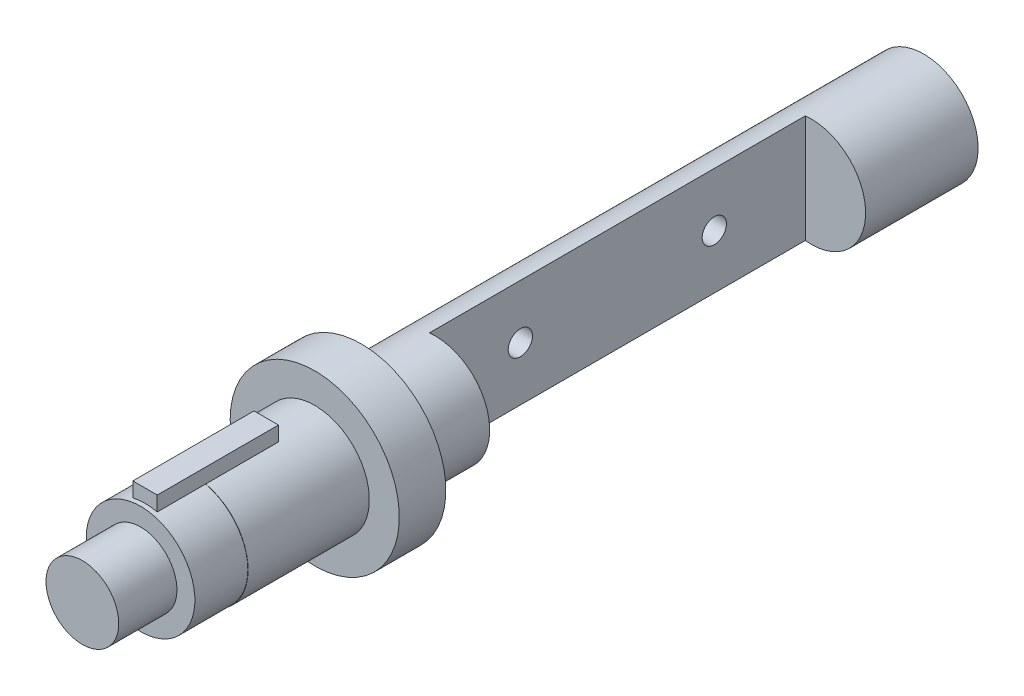
ISO-10303-21;
HEADER;
FILE_DESCRIPTION(('STEP AP214'),'2;1');
FILE_NAME('part.step','',(''),(''),'','','');
FILE_SCHEMA(('AUTOMOTIVE_DESIGN { 1 0 10303 214 1 1 1 1 }'));
ENDSEC;
DATA;
#1=APPLICATION_CONTEXT('core data for automotive mechanical design processes');
#2=APPLICATION_PROTOCOL_DEFINITION('international standard','automotive_design',2000,#1);
#3=PRODUCT_CONTEXT('',#1,'mechanical');
#4=PRODUCT('Part','Part','',(#3));
#5=PRODUCT_RELATED_PRODUCT_CATEGORY('part','',(#4));
#6=PRODUCT_DEFINITION_FORMATION('','',#4);
#7=PRODUCT_DEFINITION_CONTEXT('part definition',#1,'design');
#8=PRODUCT_DEFINITION('design','',#6,#7);
#9=PRODUCT_DEFINITION_SHAPE('','',#8);
#10=(LENGTH_UNIT() NAMED_UNIT(*) SI_UNIT(.MILLI.,.METRE.));
#11=(NAMED_UNIT(*) PLANE_ANGLE_UNIT() SI_UNIT($,.RADIAN.));
#12=(NAMED_UNIT(*) SI_UNIT($,.STERADIAN.) SOLID_ANGLE_UNIT());
#13=UNCERTAINTY_MEASURE_WITH_UNIT(LENGTH_MEASURE(1.E-05),#10,'distance_accuracy_value','');
#14=(GEOMETRIC_REPRESENTATION_CONTEXT(3) GLOBAL_UNCERTAINTY_ASSIGNED_CONTEXT((#13)) GLOBAL_UNIT_ASSIGNED_CONTEXT((#10,
#11,#12)) REPRESENTATION_CONTEXT('',''));
#15=CARTESIAN_POINT('',(0.,0.,0.));
#16=DIRECTION('',(0.,0.,1.));
#17=DIRECTION('',(1.,0.,0.));
#18=AXIS2_PLACEMENT_3D('',#15,#16,#17);
#19=CARTESIAN_POINT('',(0.,0.,376.5));
#20=DIRECTION('',(0.,0.,-1.));
#21=DIRECTION('',(-1.,0.,0.));
#22=AXIS2_PLACEMENT_3D('',#19,#20,#21);
#23=CYLINDRICAL_SURFACE('',#22,28.15);
#24=CARTESIAN_POINT('',(0.,0.,314.));
#25=DIRECTION('',(0.,0.,-1.));
#26=DIRECTION('',(-1.,0.,0.));
#27=AXIS2_PLACEMENT_3D('',#24,#25,#26);
#28=CIRCLE('',#27,28.15);
#29=CARTESIAN_POINT('',(-28.15,0.,314.));
#30=VERTEX_POINT('',#29);
#31=EDGE_CURVE('E113',#30,#30,#28,.F.);
#32=ORIENTED_EDGE('',*,*,#31,.T.);
#33=EDGE_LOOP('',(#32));
#34=FACE_BOUND('',#33,.T.);
#35=DIRECTION('',(0.,0.,-1.));
#36=VECTOR('',#35,1.);
#37=CARTESIAN_POINT('',(-6.3,27.435970914112,376.5));
#38=LINE('',#37,#36);
#39=CARTESIAN_POINT('',(-6.3,27.435970914112,339.));
#40=VERTEX_POINT('',#39);
#41=CARTESIAN_POINT('',(-6.3,27.435970914112,376.5));
#42=VERTEX_POINT('',#41);
#43=EDGE_CURVE('E95',#40,#42,#38,.F.);
#44=ORIENTED_EDGE('',*,*,#43,.F.);
#45=CARTESIAN_POINT('',(0.,0.,339.));
#46=DIRECTION('',(0.,0.,-1.));
#47=DIRECTION('',(1.,0.,0.));
#48=AXIS2_PLACEMENT_3D('',#45,#46,#47);
#49=CIRCLE('',#48,28.15);
#50=CARTESIAN_POINT('',(6.3,27.435970914112,339.));
#51=VERTEX_POINT('',#50);
#52=EDGE_CURVE('E55',#40,#51,#49,.T.);
#53=ORIENTED_EDGE('',*,*,#52,.T.);
#54=DIRECTION('',(0.,0.,-1.));
#55=VECTOR('',#54,1.);
#56=CARTESIAN_POINT('',(6.3,27.435970914112,376.5));
#57=LINE('',#56,#55);
#58=CARTESIAN_POINT('',(6.3,27.435970914112,376.5));
#59=VERTEX_POINT('',#58);
#60=EDGE_CURVE('E111',#59,#51,#57,.T.);
#61=ORIENTED_EDGE('',*,*,#60,.F.);
#62=CARTESIAN_POINT('',(0.,0.,376.5));
#63=DIRECTION('',(0.,0.,1.));
#64=DIRECTION('',(1.,0.,0.));
#65=AXIS2_PLACEMENT_3D('',#62,#63,#64);
#66=CIRCLE('',#65,28.15);
#67=EDGE_CURVE('E143',#42,#59,#66,.T.);
#68=ORIENTED_EDGE('',*,*,#67,.F.);
#69=EDGE_LOOP('',(#44,#53,#61,#68));
#70=FACE_BOUND('',#69,.T.);
#71=ADVANCED_FACE('F33',(#34,#70),#23,.T.);
#72=CARTESIAN_POINT('',(43.6,0.,314.));
#73=DIRECTION('',(0.,0.,-1.));
#74=DIRECTION('',(-1.,0.,0.));
#75=AXIS2_PLACEMENT_3D('',#72,#73,#74);
#76=PLANE('',#75);
#77=CARTESIAN_POINT('',(0.,0.,314.));
#78=DIRECTION('',(0.,0.,-1.));
#79=DIRECTION('',(-1.,0.,0.));
#80=AXIS2_PLACEMENT_3D('',#77,#78,#79);
#81=CIRCLE('',#80,43.6);
#82=CARTESIAN_POINT('',(-43.6,0.,314.));
#83=VERTEX_POINT('',#82);
#84=EDGE_CURVE('E130',#83,#83,#81,.T.);
#85=ORIENTED_EDGE('',*,*,#84,.F.);
#86=EDGE_LOOP('',(#85));
#87=FACE_BOUND('',#86,.T.);
#88=ORIENTED_EDGE('',*,*,#31,.F.);
#89=EDGE_LOOP('',(#88));
#90=FACE_BOUND('',#89,.T.);
#91=ADVANCED_FACE('F233',(#87,#90),#76,.F.);
#92=CARTESIAN_POINT('',(0.,0.,0.));
#93=DIRECTION('',(0.,0.,1.));
#94=DIRECTION('',(1.,0.,0.));
#95=AXIS2_PLACEMENT_3D('',#92,#93,#94);
#96=PLANE('',#95);
#97=CARTESIAN_POINT('',(0.,0.,0.));
#98=DIRECTION('',(0.,0.,-1.));
#99=DIRECTION('',(-1.,0.,0.));
#100=AXIS2_PLACEMENT_3D('',#97,#98,#99);
#101=CIRCLE('',#100,28.);
#102=CARTESIAN_POINT('',(-28.,0.,0.));
#103=VERTEX_POINT('',#102);
#104=EDGE_CURVE('E116',#103,#103,#101,.T.);
#105=ORIENTED_EDGE('',*,*,#104,.T.);
#106=EDGE_LOOP('',(#105));
#107=FACE_BOUND('',#106,.T.);
#108=ADVANCED_FACE('F35',(#107),#96,.F.);
#109=CARTESIAN_POINT('',(0.,0.,0.));
#110=DIRECTION('',(0.,0.,-1.));
#111=DIRECTION('',(-1.,0.,0.));
#112=AXIS2_PLACEMENT_3D('',#109,#110,#111);
#113=CYLINDRICAL_SURFACE('',#112,28.);
#114=CARTESIAN_POINT('',(-28.,0.,111.15));
#115=CARTESIAN_POINT('',(-28.0000023074908,-0.173287733266384,111.150004157336));
#116=CARTESIAN_POINT('',(-27.9983887060988,-0.346526436476237,111.142791597633));
#117=CARTESIAN_POINT('',(-27.9919844061931,-0.691798529480793,111.114009005228));
#118=CARTESIAN_POINT('',(-27.9871932468603,-0.863831740793932,111.092436890058));
#119=CARTESIAN_POINT('',(-27.9745615189513,-1.20546852164449,111.035093131679));
#120=CARTESIAN_POINT('',(-27.9667196516089,-1.37507102443781,110.999315440651));
#121=CARTESIAN_POINT('',(-27.9482014313874,-1.71063801646036,110.913834427051));
#122=CARTESIAN_POINT('',(-27.9375240354984,-1.87660114262709,110.864125979871));
#123=CARTESIAN_POINT('',(-27.9136475008796,-2.20342803103274,110.751260683326));
#124=CARTESIAN_POINT('',(-27.9004520535614,-2.36429886090372,110.688123504869));
#125=CARTESIAN_POINT('',(-27.871883694352,-2.6801600028586,110.548809422107));
#126=CARTESIAN_POINT('',(-27.8565099794538,-2.83514811947611,110.472627706833));
#127=CARTESIAN_POINT('',(-27.8240112460599,-3.13808852917943,110.307829658132));
#128=CARTESIAN_POINT('',(-27.80688694639,-3.28604367387646,110.219218423001));
#129=CARTESIAN_POINT('',(-27.7713351594849,-3.57407495168334,110.030124735688));
#130=CARTESIAN_POINT('',(-27.7529071853003,-3.71414810525704,109.929637838203));
#131=CARTESIAN_POINT('',(-27.7149723161641,-3.9874327510885,109.71595298229));
#132=CARTESIAN_POINT('',(-27.6954536070886,-4.12051440767511,109.602591043081));
#133=CARTESIAN_POINT('',(-27.656119215484,-4.37674315428556,109.365102992518));
#134=CARTESIAN_POINT('',(-27.6363034255243,-4.49988654240011,109.24097290553));
#135=CARTESIAN_POINT('',(-27.5969361383668,-4.73533123112092,108.982847645637));
#136=CARTESIAN_POINT('',(-27.5773845702219,-4.84763549399911,108.84885518581));
#137=CARTESIAN_POINT('',(-27.5390789960355,-5.06071673810811,108.571811192484));
#138=CARTESIAN_POINT('',(-27.5203252869022,-5.1614894512584,108.428756335032));
#139=CARTESIAN_POINT('',(-27.4839505199679,-5.35181850822239,108.132926851554));
#140=CARTESIAN_POINT('',(-27.4663445285225,-5.44123634312861,107.980061190684));
#141=CARTESIAN_POINT('',(-27.4330090939024,-5.60688439498471,107.667077268975));
#142=CARTESIAN_POINT('',(-27.4172803579064,-5.68310964700898,107.50695630614));
#143=CARTESIAN_POINT('',(-27.3881854150534,-5.82171201999017,107.180689184572));
#144=CARTESIAN_POINT('',(-27.3748181028623,-5.88409562345869,107.014545888894));
#145=CARTESIAN_POINT('',(-27.3508351245557,-5.99457765259043,106.677384385191));
#146=CARTESIAN_POINT('',(-27.3402204514303,-6.04267092405305,106.506364442583));
#147=CARTESIAN_POINT('',(-27.3133419530626,-6.16348147602571,105.993430160608));
#148=CARTESIAN_POINT('',(-27.3015182415445,-6.2151435701817,105.645934773249));
#149=CARTESIAN_POINT('',(-27.2938833534441,-6.24850925497446,105.122324811775));
#150=CARTESIAN_POINT('',(-27.293023499731,-6.25226931236141,104.947323914374));
#151=CARTESIAN_POINT('',(-27.2946587718572,-6.2451281854667,104.59761573857));
#152=CARTESIAN_POINT('',(-27.2971539413056,-6.23422681061352,104.422908464015));
#153=CARTESIAN_POINT('',(-27.3094493243997,-6.18026048197206,103.907898746191));
#154=CARTESIAN_POINT('',(-27.3239631647027,-6.11636371447946,103.569657624295));
#155=CARTESIAN_POINT('',(-27.364073204214,-5.93430755690993,102.908998983288));
#156=CARTESIAN_POINT('',(-27.3896700482407,-5.81614500958078,102.586582386076));
#157=CARTESIAN_POINT('',(-27.449298706518,-5.52790655715221,101.963417511138));
#158=CARTESIAN_POINT('',(-27.4833984266531,-5.35741003786138,101.662870142178));
#159=CARTESIAN_POINT('',(-27.5561513937308,-4.96963966609147,101.094257969914));
#160=CARTESIAN_POINT('',(-27.5948052853186,-4.75235918770838,100.826197776107));
#161=CARTESIAN_POINT('',(-27.6733802530295,-4.27137013352204,100.323809853688));
#162=CARTESIAN_POINT('',(-27.7133102487926,-4.00672510942756,100.090379079378));
#163=CARTESIAN_POINT('',(-27.7891457801462,-3.44158844330938,99.6710639914477));
#164=CARTESIAN_POINT('',(-27.825051236844,-3.14109609881234,99.4851806098017));
#165=CARTESIAN_POINT('',(-27.8889163273942,-2.51167474315629,99.1659996168492));
#166=CARTESIAN_POINT('',(-27.9168575843373,-2.18268221225622,99.0328233535378));
#167=CARTESIAN_POINT('',(-27.9615100011377,-1.50622494940627,98.8238955241705));
#168=CARTESIAN_POINT('',(-27.9782228632757,-1.15876302613159,98.7481352533406));
#169=CARTESIAN_POINT('',(-27.9982917913807,-0.462921185445322,98.657503392358));
#170=CARTESIAN_POINT('',(-28.0019164988762,-0.114708330446504,98.6414069828832));
#171=CARTESIAN_POINT('',(-27.9961551885656,0.579431141153254,98.6672346958011));
#172=CARTESIAN_POINT('',(-27.9867700918001,0.925357917857114,98.7091547108693));
#173=CARTESIAN_POINT('',(-27.9562136095177,1.60102042690682,98.8488100168432));
#174=CARTESIAN_POINT('',(-27.9351786925779,1.93089639113397,98.9458993779847));
#175=CARTESIAN_POINT('',(-27.8836785395351,2.56967883178063,99.1924188107427));
#176=CARTESIAN_POINT('',(-27.8532124775043,2.87858346875662,99.341853466623));
#177=CARTESIAN_POINT('',(-27.7855691492715,3.47169220712507,99.6913445604128));
#178=CARTESIAN_POINT('',(-27.7482994216928,3.75546419123479,99.8921159484656));
#179=CARTESIAN_POINT('',(-27.6713646917785,4.28573159126944,100.33766094087));
#180=CARTESIAN_POINT('',(-27.6316993650309,4.53222194260744,100.582440513721));
#181=CARTESIAN_POINT('',(-27.5535125980946,4.98578225781706,101.114619112825));
#182=CARTESIAN_POINT('',(-27.5150278704222,5.19200214503791,101.402747785557));
#183=CARTESIAN_POINT('',(-27.4444213582735,5.55318005696324,102.010464331259));
#184=CARTESIAN_POINT('',(-27.4122992950711,5.70814032737226,102.330050825253));
#185=CARTESIAN_POINT('',(-27.3718192690613,5.89809930930842,102.8248921017));
#186=CARTESIAN_POINT('',(-27.359629544755,5.95425582185383,102.992003452291));
#187=CARTESIAN_POINT('',(-27.3381107961362,6.05229245748584,103.330526424614));
#188=CARTESIAN_POINT('',(-27.328780707491,6.09417789279904,103.501936420666));
#189=CARTESIAN_POINT('',(-27.3132698536945,6.1633222792762,103.847820829415));
#190=CARTESIAN_POINT('',(-27.3070892654712,6.1905804087338,104.022295413702));
#191=CARTESIAN_POINT('',(-27.2980677291033,6.23024201169865,104.373008747092));
#192=CARTESIAN_POINT('',(-27.2952266431118,6.24264609834679,104.549247423074));
#193=CARTESIAN_POINT('',(-27.2929984334104,6.25238023667573,104.898143905916));
#194=CARTESIAN_POINT('',(-27.2935341846289,6.25004688074713,105.070791939161));
#195=CARTESIAN_POINT('',(-27.2978631892482,6.23111223119597,105.415259970258));
#196=CARTESIAN_POINT('',(-27.3016563761432,6.21451122887041,105.587079984945));
#197=CARTESIAN_POINT('',(-27.312388186828,6.16717429747139,105.92868909271));
#198=CARTESIAN_POINT('',(-27.3193273222638,6.13643606915782,106.098477850821));
#199=CARTESIAN_POINT('',(-27.3361431472941,6.06108612830197,106.434734955742));
#200=CARTESIAN_POINT('',(-27.346018795126,6.01647933554219,106.601204457786));
#201=CARTESIAN_POINT('',(-27.3683819096737,5.91391695166168,106.929163456557));
#202=CARTESIAN_POINT('',(-27.3808602567916,5.85600790038149,107.090668140427));
#203=CARTESIAN_POINT('',(-27.4080885496009,5.72721655121537,107.408152063312));
#204=CARTESIAN_POINT('',(-27.4228376985692,5.65633880183057,107.564133216768));
#205=CARTESIAN_POINT('',(-27.4542043948438,5.50207735834757,107.869670897887));
#206=CARTESIAN_POINT('',(-27.4708227471991,5.41868827052606,108.019224618692));
#207=CARTESIAN_POINT('',(-27.5054585978042,5.24004005325542,108.310822128643));
#208=CARTESIAN_POINT('',(-27.5234756244719,5.14478491811208,108.452868422104));
#209=CARTESIAN_POINT('',(-27.5608208365801,4.94086270821177,108.731556083576));
#210=CARTESIAN_POINT('',(-27.5801688265783,4.8319522956479,108.868016801897));
#211=CARTESIAN_POINT('',(-27.6192728309798,4.60317572148808,109.1312733688));
#212=CARTESIAN_POINT('',(-27.6390287017367,4.48331336764064,109.258072548577));
#213=CARTESIAN_POINT('',(-27.6784207302393,4.23332522432967,109.501291919222));
#214=CARTESIAN_POINT('',(-27.6980568104059,4.10319341611152,109.617705937093));
#215=CARTESIAN_POINT('',(-27.7366498543231,3.833638256623,109.839245082892));
#216=CARTESIAN_POINT('',(-27.7556070643538,3.6942183284854,109.944374332922));
#217=CARTESIAN_POINT('',(-27.7925873438731,3.40494373096442,110.144061116773));
#218=CARTESIAN_POINT('',(-27.8105935516115,3.25496999808167,110.238449412463));
#219=CARTESIAN_POINT('',(-27.8448634637059,2.94745730260299,110.414195222934));
#220=CARTESIAN_POINT('',(-27.8611278091305,2.78992115437887,110.495557537243));
#221=CARTESIAN_POINT('',(-27.8914504457954,2.46840729727077,110.644635667202));
#222=CARTESIAN_POINT('',(-27.9055099063002,2.30443306062931,110.712358721292));
#223=CARTESIAN_POINT('',(-27.9310283273156,1.97119532300798,110.833661963131));
#224=CARTESIAN_POINT('',(-27.9424877419764,1.80193275162733,110.887244621052));
#225=CARTESIAN_POINT('',(-27.9679417662881,1.36548835922047,111.005183303216));
#226=CARTESIAN_POINT('',(-27.9798958519049,1.0953766455279,111.059407046202));
#227=CARTESIAN_POINT('',(-27.9959229491087,0.550135299286094,111.131811232906));
#228=CARTESIAN_POINT('',(-27.9999963380351,0.27500590762742,111.149993402349));
#229=CARTESIAN_POINT('',(-28.,0.,111.15));
#230=B_SPLINE_CURVE_WITH_KNOTS('',3,(#114,#115,#116,#117,#118,#119,#120,#121,#122,#123,#124,
#125,#126,#127,#128,#129,#130,#131,#132,#133,#134,#135,#136,#137,#138,#139,#140,#141,#142,#143,
#144,#145,#146,#147,#148,#149,#150,#151,#152,#153,#154,#155,#156,#157,#158,#159,#160,#161,#162,
#163,#164,#165,#166,#167,#168,#169,#170,#171,#172,#173,#174,#175,#176,#177,#178,#179,#180,#181,
#182,#183,#184,#185,#186,#187,#188,#189,#190,#191,#192,#193,#194,#195,#196,#197,#198,#199,#200,
#201,#202,#203,#204,#205,#206,#207,#208,#209,#210,#211,#212,#213,#214,#215,#216,#217,#218,#219,
#220,#221,#222,#223,#224,#225,#226,#227,#228,#229),.UNSPECIFIED.,.T.,.F.,(4,2,2,2,2,2,2,2,2,2,2,
2,2,2,2,2,2,2,2,2,2,2,2,2,2,2,2,2,2,2,2,2,2,2,2,2,2,2,2,2,2,2,2,2,2,2,2,2,2,2,2,2,2,2,2,2,2,4),
(0.,0.51962135543926,1.03931808443778,1.55923630446094,2.07934603473738,2.5986990723214,
3.11824406723571,3.63757657682149,4.1571041026273,4.68420711823536,5.21150557703532,
5.73865951763687,6.26600794272353,6.7992722439443,7.33273680068078,7.86595098810626,
8.39935726107371,9.44774844022995,9.97235964957357,10.4969776779593,11.5252983768463,
12.5536789123229,13.5905512322956,14.6275704988053,15.6879740503837,16.7483983853176,
17.8112501352815,18.8739407152331,19.9146908936509,20.9553673950021,21.9841034233241,
23.0129295681878,24.0569484922651,25.1011091157344,26.1653675706146,27.2295793937244,
27.7591901244012,28.2886034983027,28.8180466095191,29.3474678657824,29.8648419429658,
30.3822054573744,30.8996531441531,31.41691747879,31.9323989349574,32.4476999420771,
32.9632237407066,33.4785744721473,34.0049506918991,34.5311445936063,35.0576492123302,
35.5839608501371,36.1176653274807,36.6511727022891,37.184396190977,37.7175264696495,
38.5421998754906,39.3668337937813),.UNSPECIFIED.);
#231=CARTESIAN_POINT('',(-28.,0.,111.15));
#232=VERTEX_POINT('',#231);
#233=EDGE_CURVE('E296',#232,#232,#230,.T.);
#234=ORIENTED_EDGE('',*,*,#233,.T.);
#235=EDGE_LOOP('',(#234));
#236=FACE_BOUND('',#235,.T.);
#237=CARTESIAN_POINT('',(-28.,0.,211.15));
#238=CARTESIAN_POINT('',(-28.0000023074908,-0.173287733266385,211.150004157336));
#239=CARTESIAN_POINT('',(-27.9983887060988,-0.346526436476238,211.142791597633));
#240=CARTESIAN_POINT('',(-27.9919844061931,-0.691798529480793,211.114009005228));
#241=CARTESIAN_POINT('',(-27.9871932468603,-0.863831740793932,211.092436890058));
#242=CARTESIAN_POINT('',(-27.9745615189513,-1.20546852164449,211.035093131679));
#243=CARTESIAN_POINT('',(-27.9667196516089,-1.37507102443781,210.99931544065));
#244=CARTESIAN_POINT('',(-27.9482014313874,-1.71063801646037,210.913834427051));
#245=CARTESIAN_POINT('',(-27.9375240354984,-1.87660114262709,210.864125979871));
#246=CARTESIAN_POINT('',(-27.9136475008796,-2.20342803103274,210.751260683326));
#247=CARTESIAN_POINT('',(-27.9004520535614,-2.36429886090373,210.688123504869));
#248=CARTESIAN_POINT('',(-27.871883694352,-2.68016000285861,210.548809422107));
#249=CARTESIAN_POINT('',(-27.8565099794538,-2.83514811947613,210.472627706833));
#250=CARTESIAN_POINT('',(-27.8240112460599,-3.13808852917943,210.307829658132));
#251=CARTESIAN_POINT('',(-27.8068869463899,-3.28604367387646,210.219218423001));
#252=CARTESIAN_POINT('',(-27.7713351594849,-3.57407495168333,210.030124735688));
#253=CARTESIAN_POINT('',(-27.7529071853003,-3.71414810525704,209.929637838203));
#254=CARTESIAN_POINT('',(-27.7149723161641,-3.98743275108849,209.71595298229));
#255=CARTESIAN_POINT('',(-27.6954536070886,-4.12051440767511,209.602591043081));
#256=CARTESIAN_POINT('',(-27.656119215484,-4.37674315428556,209.365102992518));
#257=CARTESIAN_POINT('',(-27.6363034255243,-4.49988654240012,209.24097290553));
#258=CARTESIAN_POINT('',(-27.5969361383667,-4.73533123112093,208.982847645637));
#259=CARTESIAN_POINT('',(-27.5773845702219,-4.84763549399912,208.84885518581));
#260=CARTESIAN_POINT('',(-27.5390789960355,-5.06071673810811,208.571811192484));
#261=CARTESIAN_POINT('',(-27.5203252869022,-5.1614894512584,208.428756335032));
#262=CARTESIAN_POINT('',(-27.4839505199679,-5.35181850822239,208.132926851554));
#263=CARTESIAN_POINT('',(-27.4663445285225,-5.44123634312861,207.980061190684));
#264=CARTESIAN_POINT('',(-27.4330090939024,-5.60688439498472,207.667077268975));
#265=CARTESIAN_POINT('',(-27.4172803579064,-5.68310964700899,207.50695630614));
#266=CARTESIAN_POINT('',(-27.3881854150534,-5.82171201999018,207.180689184572));
#267=CARTESIAN_POINT('',(-27.3748181028623,-5.8840956234587,207.014545888894));
#268=CARTESIAN_POINT('',(-27.3508351245557,-5.99457765259043,206.677384385191));
#269=CARTESIAN_POINT('',(-27.3402204514303,-6.04267092405305,206.506364442583));
#270=CARTESIAN_POINT('',(-27.3133419530626,-6.16348147602571,205.993430160608));
#271=CARTESIAN_POINT('',(-27.3015182415445,-6.2151435701817,205.645934773249));
#272=CARTESIAN_POINT('',(-27.2938833534441,-6.24850925497446,205.122324811775));
#273=CARTESIAN_POINT('',(-27.293023499731,-6.2522693123614,204.947323914374));
#274=CARTESIAN_POINT('',(-27.2946587718572,-6.2451281854667,204.597615738571));
#275=CARTESIAN_POINT('',(-27.2971539413056,-6.23422681061352,204.422908464015));
#276=CARTESIAN_POINT('',(-27.3094493243997,-6.18026048197206,203.907898746191));
#277=CARTESIAN_POINT('',(-27.3239631647027,-6.11636371447946,203.569657624295));
#278=CARTESIAN_POINT('',(-27.364073204214,-5.93430755690992,202.908998983288));
#279=CARTESIAN_POINT('',(-27.3896700482407,-5.81614500958078,202.586582386076));
#280=CARTESIAN_POINT('',(-27.449298706518,-5.5279065571522,201.963417511138));
#281=CARTESIAN_POINT('',(-27.4833984266531,-5.35741003786137,201.662870142178));
#282=CARTESIAN_POINT('',(-27.5561513937308,-4.96963966609146,201.094257969914));
#283=CARTESIAN_POINT('',(-27.5948052853186,-4.75235918770836,200.826197776107));
#284=CARTESIAN_POINT('',(-27.6733802530295,-4.27137013352202,200.323809853688));
#285=CARTESIAN_POINT('',(-27.7133102487926,-4.00672510942755,200.090379079378));
#286=CARTESIAN_POINT('',(-27.7891457801462,-3.44158844330936,199.671063991448));
#287=CARTESIAN_POINT('',(-27.825051236844,-3.14109609881232,199.485180609802));
#288=CARTESIAN_POINT('',(-27.8889163273942,-2.51167474315627,199.165999616849));
#289=CARTESIAN_POINT('',(-27.9168575843373,-2.18268221225621,199.032823353538));
#290=CARTESIAN_POINT('',(-27.9615100011377,-1.50622494940626,198.823895524171));
#291=CARTESIAN_POINT('',(-27.9782228632757,-1.15876302613157,198.748135253341));
#292=CARTESIAN_POINT('',(-27.9982917913807,-0.462921185445313,198.657503392358));
#293=CARTESIAN_POINT('',(-28.0019164988762,-0.114708330446496,198.641406982883));
#294=CARTESIAN_POINT('',(-27.9961551885656,0.579431141153261,198.667234695801));
#295=CARTESIAN_POINT('',(-27.9867700918001,0.925357917857121,198.709154710869));
#296=CARTESIAN_POINT('',(-27.9562136095177,1.60102042690682,198.848810016843));
#297=CARTESIAN_POINT('',(-27.9351786925779,1.93089639113397,198.945899377985));
#298=CARTESIAN_POINT('',(-27.8836785395351,2.56967883178063,199.192418810743));
#299=CARTESIAN_POINT('',(-27.8532124775043,2.87858346875663,199.341853466623));
#300=CARTESIAN_POINT('',(-27.7855691492715,3.47169220712509,199.691344560413));
#301=CARTESIAN_POINT('',(-27.7482994216928,3.75546419123481,199.892115948466));
#302=CARTESIAN_POINT('',(-27.6713646917785,4.28573159126946,200.33766094087));
#303=CARTESIAN_POINT('',(-27.6316993650309,4.53222194260746,200.582440513721));
#304=CARTESIAN_POINT('',(-27.5535125980946,4.98578225781707,201.114619112825));
#305=CARTESIAN_POINT('',(-27.5150278704222,5.19200214503791,201.402747785557));
#306=CARTESIAN_POINT('',(-27.4444213582735,5.55318005696324,202.010464331259));
#307=CARTESIAN_POINT('',(-27.4122992950711,5.70814032737227,202.330050825253));
#308=CARTESIAN_POINT('',(-27.3718192690613,5.89809930930842,202.8248921017));
#309=CARTESIAN_POINT('',(-27.359629544755,5.95425582185383,202.992003452291));
#310=CARTESIAN_POINT('',(-27.3381107961362,6.05229245748584,203.330526424614));
#311=CARTESIAN_POINT('',(-27.328780707491,6.09417789279905,203.501936420666));
#312=CARTESIAN_POINT('',(-27.3132698536945,6.1633222792762,203.847820829415));
#313=CARTESIAN_POINT('',(-27.3070892654712,6.19058040873381,204.022295413702));
#314=CARTESIAN_POINT('',(-27.2980677291033,6.23024201169866,204.373008747092));
#315=CARTESIAN_POINT('',(-27.2952266431118,6.24264609834679,204.549247423074));
#316=CARTESIAN_POINT('',(-27.2929984334104,6.25238023667573,204.898143905916));
#317=CARTESIAN_POINT('',(-27.2935341846289,6.25004688074713,205.070791939161));
#318=CARTESIAN_POINT('',(-27.2978631892482,6.23111223119597,205.415259970258));
#319=CARTESIAN_POINT('',(-27.3016563761432,6.21451122887041,205.587079984945));
#320=CARTESIAN_POINT('',(-27.312388186828,6.16717429747139,205.92868909271));
#321=CARTESIAN_POINT('',(-27.3193273222638,6.13643606915781,206.098477850821));
#322=CARTESIAN_POINT('',(-27.3361431472941,6.06108612830196,206.434734955742));
#323=CARTESIAN_POINT('',(-27.346018795126,6.01647933554219,206.601204457786));
#324=CARTESIAN_POINT('',(-27.3683819096737,5.91391695166169,206.929163456557));
#325=CARTESIAN_POINT('',(-27.3808602567916,5.8560079003815,207.090668140427));
#326=CARTESIAN_POINT('',(-27.4080885496009,5.72721655121538,207.408152063312));
#327=CARTESIAN_POINT('',(-27.4228376985692,5.65633880183057,207.564133216768));
#328=CARTESIAN_POINT('',(-27.4542043948438,5.50207735834757,207.869670897887));
#329=CARTESIAN_POINT('',(-27.4708227471991,5.41868827052607,208.019224618692));
#330=CARTESIAN_POINT('',(-27.5054585978042,5.24004005325543,208.310822128643));
#331=CARTESIAN_POINT('',(-27.5234756244719,5.14478491811208,208.452868422104));
#332=CARTESIAN_POINT('',(-27.5608208365801,4.94086270821176,208.731556083576));
#333=CARTESIAN_POINT('',(-27.5801688265783,4.8319522956479,208.868016801897));
#334=CARTESIAN_POINT('',(-27.6192728309798,4.60317572148808,209.131273368799));
#335=CARTESIAN_POINT('',(-27.6390287017367,4.48331336764064,209.258072548577));
#336=CARTESIAN_POINT('',(-27.6784207302393,4.23332522432966,209.501291919222));
#337=CARTESIAN_POINT('',(-27.6980568104059,4.10319341611151,209.617705937093));
#338=CARTESIAN_POINT('',(-27.7366498543231,3.83363825662299,209.839245082892));
#339=CARTESIAN_POINT('',(-27.7556070643538,3.69421832848538,209.944374332922));
#340=CARTESIAN_POINT('',(-27.7925873438731,3.40494373096441,210.144061116773));
#341=CARTESIAN_POINT('',(-27.8105935516115,3.25496999808167,210.238449412463));
#342=CARTESIAN_POINT('',(-27.8448634637059,2.94745730260298,210.414195222934));
#343=CARTESIAN_POINT('',(-27.8611278091305,2.78992115437886,210.495557537243));
#344=CARTESIAN_POINT('',(-27.8914504457954,2.46840729727077,210.644635667202));
#345=CARTESIAN_POINT('',(-27.9055099063002,2.30443306062931,210.712358721292));
#346=CARTESIAN_POINT('',(-27.9310283273156,1.97119532300798,210.833661963131));
#347=CARTESIAN_POINT('',(-27.9424877419764,1.80193275162733,210.887244621052));
#348=CARTESIAN_POINT('',(-27.9679417662881,1.36548835922047,211.005183303216));
#349=CARTESIAN_POINT('',(-27.9798958519049,1.0953766455279,211.059407046202));
#350=CARTESIAN_POINT('',(-27.9959229491087,0.550135299286094,211.131811232906));
#351=CARTESIAN_POINT('',(-27.9999963380351,0.275005907627419,211.149993402349));
#352=CARTESIAN_POINT('',(-28.,0.,211.15));
#353=B_SPLINE_CURVE_WITH_KNOTS('',3,(#237,#238,#239,#240,#241,#242,#243,#244,#245,#246,#247,
#248,#249,#250,#251,#252,#253,#254,#255,#256,#257,#258,#259,#260,#261,#262,#263,#264,#265,#266,
#267,#268,#269,#270,#271,#272,#273,#274,#275,#276,#277,#278,#279,#280,#281,#282,#283,#284,#285,
#286,#287,#288,#289,#290,#291,#292,#293,#294,#295,#296,#297,#298,#299,#300,#301,#302,#303,#304,
#305,#306,#307,#308,#309,#310,#311,#312,#313,#314,#315,#316,#317,#318,#319,#320,#321,#322,#323,
#324,#325,#326,#327,#328,#329,#330,#331,#332,#333,#334,#335,#336,#337,#338,#339,#340,#341,#342,
#343,#344,#345,#346,#347,#348,#349,#350,#351,#352),.UNSPECIFIED.,.T.,.F.,(4,2,2,2,2,2,2,2,2,2,2,
2,2,2,2,2,2,2,2,2,2,2,2,2,2,2,2,2,2,2,2,2,2,2,2,2,2,2,2,2,2,2,2,2,2,2,2,2,2,2,2,2,2,2,2,2,2,4),
(0.,0.519621355439262,1.03931808443778,1.55923630446094,2.07934603473738,2.59869907232141,
3.11824406723572,3.63757657682148,4.15710410262729,4.68420711823537,5.21150557703534,
5.73865951763685,6.26600794272354,6.79927224394432,7.33273680068082,7.86595098810629,
8.39935726107372,9.44774844022994,9.97235964957352,10.4969776779593,11.5252983768463,
12.5536789123229,13.5905512322956,14.6275704988054,15.6879740503837,16.7483983853177,
17.8112501352815,18.8739407152331,19.9146908936509,20.9553673950021,21.9841034233241,
23.0129295681878,24.0569484922651,25.1011091157344,26.1653675706146,27.2295793937244,
27.7591901244012,28.2886034983027,28.8180466095191,29.3474678657824,29.8648419429658,
30.3822054573745,30.8996531441532,31.41691747879,31.9323989349574,32.4476999420771,
32.9632237407065,33.4785744721473,34.0049506918991,34.5311445936063,35.0576492123303,
35.5839608501371,36.1176653274807,36.6511727022891,37.184396190977,37.7175264696495,
38.5421998754906,39.3668337937813),.UNSPECIFIED.);
#354=CARTESIAN_POINT('',(-28.,0.,211.15));
#355=VERTEX_POINT('',#354);
#356=EDGE_CURVE('E103',#355,#355,#353,.T.);
#357=ORIENTED_EDGE('',*,*,#356,.T.);
#358=EDGE_LOOP('',(#357));
#359=FACE_BOUND('',#358,.T.);
#360=CARTESIAN_POINT('',(0.,0.,251.8));
#361=DIRECTION('',(0.,0.,1.));
#362=DIRECTION('',(1.,0.,0.));
#363=AXIS2_PLACEMENT_3D('',#360,#361,#362);
#364=CIRCLE('',#363,28.);
#365=CARTESIAN_POINT('',(-3.09999999999996,-27.8278637340347,251.8));
#366=VERTEX_POINT('',#365);
#367=CARTESIAN_POINT('',(-3.09999999999996,27.8278637340347,251.8));
#368=VERTEX_POINT('',#367);
#369=EDGE_CURVE('E11',#366,#368,#364,.T.);
#370=ORIENTED_EDGE('',*,*,#369,.T.);
#371=DIRECTION('',(0.,0.,-1.));
#372=VECTOR('',#371,1.);
#373=CARTESIAN_POINT('',(-3.09999999999999,27.8278637340347,0.));
#374=LINE('',#373,#372);
#375=CARTESIAN_POINT('',(-3.09999999999998,27.8278637340347,58.));
#376=VERTEX_POINT('',#375);
#377=EDGE_CURVE('E41',#368,#376,#374,.T.);
#378=ORIENTED_EDGE('',*,*,#377,.T.);
#379=CARTESIAN_POINT('',(0.,0.,58.));
#380=DIRECTION('',(0.,0.,-1.));
#381=DIRECTION('',(-1.,0.,0.));
#382=AXIS2_PLACEMENT_3D('',#379,#380,#381);
#383=CIRCLE('',#382,28.);
#384=CARTESIAN_POINT('',(-3.09999999999998,-27.8278637340347,58.));
#385=VERTEX_POINT('',#384);
#386=EDGE_CURVE('E89',#376,#385,#383,.T.);
#387=ORIENTED_EDGE('',*,*,#386,.T.);
#388=DIRECTION('',(0.,0.,-1.));
#389=VECTOR('',#388,1.);
#390=CARTESIAN_POINT('',(-3.09999999999999,-27.8278637340347,0.));
#391=LINE('',#390,#389);
#392=EDGE_CURVE('E94',#385,#366,#391,.F.);
#393=ORIENTED_EDGE('',*,*,#392,.T.);
#394=EDGE_LOOP('',(#370,#378,#387,#393));
#395=FACE_BOUND('',#394,.T.);
#396=ORIENTED_EDGE('',*,*,#104,.F.);
#397=EDGE_LOOP('',(#396));
#398=FACE_BOUND('',#397,.T.);
#399=CARTESIAN_POINT('',(0.,0.,290.));
#400=DIRECTION('',(0.,0.,-1.));
#401=DIRECTION('',(-1.,0.,0.));
#402=AXIS2_PLACEMENT_3D('',#399,#400,#401);
#403=CIRCLE('',#402,28.);
#404=CARTESIAN_POINT('',(-28.,0.,290.));
#405=VERTEX_POINT('',#404);
#406=EDGE_CURVE('E124',#405,#405,#403,.T.);
#407=ORIENTED_EDGE('',*,*,#406,.T.);
#408=EDGE_LOOP('',(#407));
#409=FACE_BOUND('',#408,.T.);
#410=ADVANCED_FACE('F105',(#236,#359,#395,#398,#409),#113,.T.);
#411=CARTESIAN_POINT('',(28.,0.,290.));
#412=DIRECTION('',(0.,0.,1.));
#413=DIRECTION('',(1.,0.,0.));
#414=AXIS2_PLACEMENT_3D('',#411,#412,#413);
#415=PLANE('',#414);
#416=ORIENTED_EDGE('',*,*,#406,.F.);
#417=EDGE_LOOP('',(#416));
#418=FACE_BOUND('',#417,.T.);
#419=CARTESIAN_POINT('',(0.,0.,290.));
#420=DIRECTION('',(0.,0.,-1.));
#421=DIRECTION('',(-1.,0.,0.));
#422=AXIS2_PLACEMENT_3D('',#419,#420,#421);
#423=CIRCLE('',#422,43.6);
#424=CARTESIAN_POINT('',(-43.6,0.,290.));
#425=VERTEX_POINT('',#424);
#426=EDGE_CURVE('E127',#425,#425,#423,.T.);
#427=ORIENTED_EDGE('',*,*,#426,.T.);
#428=EDGE_LOOP('',(#427));
#429=FACE_BOUND('',#428,.T.);
#430=ADVANCED_FACE('F253',(#418,#429),#415,.F.);
#431=CARTESIAN_POINT('',(0.,0.,0.));
#432=DIRECTION('',(0.,0.,-1.));
#433=DIRECTION('',(-1.,0.,0.));
#434=AXIS2_PLACEMENT_3D('',#431,#432,#433);
#435=CYLINDRICAL_SURFACE('',#434,43.6);
#436=ORIENTED_EDGE('',*,*,#426,.F.);
#437=EDGE_LOOP('',(#436));
#438=FACE_BOUND('',#437,.T.);
#439=ORIENTED_EDGE('',*,*,#84,.T.);
#440=EDGE_LOOP('',(#439));
#441=FACE_BOUND('',#440,.T.);
#442=ADVANCED_FACE('F229',(#438,#441),#435,.T.);
#443=CARTESIAN_POINT('',(0.,0.,376.5));
#444=DIRECTION('',(0.,0.,1.));
#445=DIRECTION('',(1.,0.,0.));
#446=AXIS2_PLACEMENT_3D('',#443,#444,#445);
#447=PLANE('',#446);
#448=EDGE_CURVE('E121',#59,#42,#66,.T.);
#449=ORIENTED_EDGE('',*,*,#448,.T.);
#450=ORIENTED_EDGE('',*,*,#67,.T.);
#451=EDGE_LOOP('',(#449,#450));
#452=FACE_BOUND('',#451,.T.);
#453=CARTESIAN_POINT('',(0.,0.,376.5));
#454=DIRECTION('',(0.,0.,1.));
#455=DIRECTION('',(1.,0.,0.));
#456=AXIS2_PLACEMENT_3D('',#453,#454,#455);
#457=CIRCLE('',#456,28.);
#458=CARTESIAN_POINT('',(28.,0.,376.5));
#459=VERTEX_POINT('',#458);
#460=EDGE_CURVE('E117',#459,#459,#457,.T.);
#461=ORIENTED_EDGE('',*,*,#460,.F.);
#462=EDGE_LOOP('',(#461));
#463=FACE_BOUND('',#462,.T.);
#464=ADVANCED_FACE('F225',(#452,#463),#447,.T.);
#465=CARTESIAN_POINT('',(18.75,0.,433.8));
#466=DIRECTION('',(0.,0.,-1.));
#467=DIRECTION('',(-1.,0.,0.));
#468=AXIS2_PLACEMENT_3D('',#465,#466,#467);
#469=PLANE('',#468);
#470=CARTESIAN_POINT('',(0.,0.,433.8));
#471=DIRECTION('',(0.,0.,-1.));
#472=DIRECTION('',(-1.,0.,0.));
#473=AXIS2_PLACEMENT_3D('',#470,#471,#472);
#474=CIRCLE('',#473,18.75);
#475=CARTESIAN_POINT('',(-18.75,0.,433.8));
#476=VERTEX_POINT('',#475);
#477=EDGE_CURVE('E120',#476,#476,#474,.T.);
#478=ORIENTED_EDGE('',*,*,#477,.F.);
#479=EDGE_LOOP('',(#478));
#480=FACE_BOUND('',#479,.T.);
#481=ADVANCED_FACE('F228',(#480),#469,.F.);
#482=CARTESIAN_POINT('',(0.,0.,0.));
#483=DIRECTION('',(0.,0.,-1.));
#484=DIRECTION('',(-1.,0.,0.));
#485=AXIS2_PLACEMENT_3D('',#482,#483,#484);
#486=CYLINDRICAL_SURFACE('',#485,18.75);
#487=CARTESIAN_POINT('',(0.,0.,403.8));
#488=DIRECTION('',(0.,0.,-1.));
#489=DIRECTION('',(-1.,0.,0.));
#490=AXIS2_PLACEMENT_3D('',#487,#488,#489);
#491=CIRCLE('',#490,18.75);
#492=CARTESIAN_POINT('',(-18.75,0.,403.8));
#493=VERTEX_POINT('',#492);
#494=EDGE_CURVE('E136',#493,#493,#491,.T.);
#495=ORIENTED_EDGE('',*,*,#494,.F.);
#496=EDGE_LOOP('',(#495));
#497=FACE_BOUND('',#496,.T.);
#498=ORIENTED_EDGE('',*,*,#477,.T.);
#499=EDGE_LOOP('',(#498));
#500=FACE_BOUND('',#499,.T.);
#501=ADVANCED_FACE('F237',(#497,#500),#486,.T.);
#502=CARTESIAN_POINT('',(28.,0.,403.8));
#503=DIRECTION('',(0.,0.,-1.));
#504=DIRECTION('',(-1.,0.,0.));
#505=AXIS2_PLACEMENT_3D('',#502,#503,#504);
#506=PLANE('',#505);
#507=CARTESIAN_POINT('',(0.,0.,403.8));
#508=DIRECTION('',(0.,0.,-1.));
#509=DIRECTION('',(-1.,0.,0.));
#510=AXIS2_PLACEMENT_3D('',#507,#508,#509);
#511=CIRCLE('',#510,28.);
#512=CARTESIAN_POINT('',(-28.,0.,403.8));
#513=VERTEX_POINT('',#512);
#514=EDGE_CURVE('E133',#513,#513,#511,.T.);
#515=ORIENTED_EDGE('',*,*,#514,.F.);
#516=EDGE_LOOP('',(#515));
#517=FACE_BOUND('',#516,.T.);
#518=ORIENTED_EDGE('',*,*,#494,.T.);
#519=EDGE_LOOP('',(#518));
#520=FACE_BOUND('',#519,.T.);
#521=ADVANCED_FACE('F241',(#517,#520),#506,.F.);
#522=CARTESIAN_POINT('',(0.,0.,0.));
#523=DIRECTION('',(0.,0.,-1.));
#524=DIRECTION('',(-1.,0.,0.));
#525=AXIS2_PLACEMENT_3D('',#522,#523,#524);
#526=CYLINDRICAL_SURFACE('',#525,28.);
#527=ORIENTED_EDGE('',*,*,#460,.T.);
#528=EDGE_LOOP('',(#527));
#529=FACE_BOUND('',#528,.T.);
#530=ORIENTED_EDGE('',*,*,#514,.T.);
#531=EDGE_LOOP('',(#530));
#532=FACE_BOUND('',#531,.T.);
#533=ADVANCED_FACE('F223',(#529,#532),#526,.T.);
#534=CARTESIAN_POINT('',(-6.3,35.,401.5));
#535=DIRECTION('',(1.,0.,0.));
#536=DIRECTION('',(0.,0.,-1.));
#537=AXIS2_PLACEMENT_3D('',#534,#535,#536);
#538=PLANE('',#537);
#539=DIRECTION('',(0.,-1.,0.));
#540=VECTOR('',#539,1.);
#541=CARTESIAN_POINT('',(-6.3,35.,339.));
#542=LINE('',#541,#540);
#543=CARTESIAN_POINT('',(-6.3,35.,339.));
#544=VERTEX_POINT('',#543);
#545=EDGE_CURVE('E163',#544,#40,#542,.T.);
#546=ORIENTED_EDGE('',*,*,#545,.T.);
#547=ORIENTED_EDGE('',*,*,#43,.T.);
#548=DIRECTION('',(0.,0.,-1.));
#549=VECTOR('',#548,1.);
#550=CARTESIAN_POINT('',(-6.3,27.435970914112,401.5));
#551=LINE('',#550,#549);
#552=CARTESIAN_POINT('',(-6.3,27.435970914112,401.5));
#553=VERTEX_POINT('',#552);
#554=EDGE_CURVE('E144',#553,#42,#551,.T.);
#555=ORIENTED_EDGE('',*,*,#554,.F.);
#556=DIRECTION('',(0.,-1.,0.));
#557=VECTOR('',#556,1.);
#558=CARTESIAN_POINT('',(-6.3,35.,401.5));
#559=LINE('',#558,#557);
#560=CARTESIAN_POINT('',(-6.3,35.,401.5));
#561=VERTEX_POINT('',#560);
#562=EDGE_CURVE('E159',#561,#553,#559,.T.);
#563=ORIENTED_EDGE('',*,*,#562,.F.);
#564=DIRECTION('',(0.,0.,-1.));
#565=VECTOR('',#564,1.);
#566=CARTESIAN_POINT('',(-6.3,35.,401.5));
#567=LINE('',#566,#565);
#568=EDGE_CURVE('E153',#561,#544,#567,.T.);
#569=ORIENTED_EDGE('',*,*,#568,.T.);
#570=EDGE_LOOP('',(#546,#547,#555,#563,#569));
#571=FACE_BOUND('',#570,.T.);
#572=ADVANCED_FACE('F219',(#571),#538,.F.);
#573=CARTESIAN_POINT('',(0.,0.,401.5));
#574=DIRECTION('',(0.,0.,-1.));
#575=DIRECTION('',(-1.,0.,0.));
#576=AXIS2_PLACEMENT_3D('',#573,#574,#575);
#577=CYLINDRICAL_SURFACE('',#576,28.15);
#578=ORIENTED_EDGE('',*,*,#448,.F.);
#579=DIRECTION('',(0.,0.,-1.));
#580=VECTOR('',#579,1.);
#581=CARTESIAN_POINT('',(6.3,27.435970914112,401.5));
#582=LINE('',#581,#580);
#583=CARTESIAN_POINT('',(6.3,27.435970914112,401.5));
#584=VERTEX_POINT('',#583);
#585=EDGE_CURVE('E147',#584,#59,#582,.T.);
#586=ORIENTED_EDGE('',*,*,#585,.F.);
#587=CARTESIAN_POINT('',(0.,0.,401.5));
#588=DIRECTION('',(0.,0.,-1.));
#589=DIRECTION('',(1.,0.,0.));
#590=AXIS2_PLACEMENT_3D('',#587,#588,#589);
#591=CIRCLE('',#590,28.15);
#592=EDGE_CURVE('E169',#553,#584,#591,.T.);
#593=ORIENTED_EDGE('',*,*,#592,.F.);
#594=ORIENTED_EDGE('',*,*,#554,.T.);
#595=EDGE_LOOP('',(#578,#586,#593,#594));
#596=FACE_BOUND('',#595,.T.);
#597=ADVANCED_FACE('F215',(#596),#577,.F.);
#598=CARTESIAN_POINT('',(6.3,35.,401.5));
#599=DIRECTION('',(-1.,0.,0.));
#600=DIRECTION('',(0.,0.,1.));
#601=AXIS2_PLACEMENT_3D('',#598,#599,#600);
#602=PLANE('',#601);
#603=DIRECTION('',(0.,1.,0.));
#604=VECTOR('',#603,1.);
#605=CARTESIAN_POINT('',(6.3,35.,339.));
#606=LINE('',#605,#604);
#607=CARTESIAN_POINT('',(6.3,35.,339.));
#608=VERTEX_POINT('',#607);
#609=EDGE_CURVE('E160',#51,#608,#606,.T.);
#610=ORIENTED_EDGE('',*,*,#609,.T.);
#611=DIRECTION('',(0.,0.,-1.));
#612=VECTOR('',#611,1.);
#613=CARTESIAN_POINT('',(6.3,35.,401.5));
#614=LINE('',#613,#612);
#615=CARTESIAN_POINT('',(6.3,35.,401.5));
#616=VERTEX_POINT('',#615);
#617=EDGE_CURVE('E150',#616,#608,#614,.T.);
#618=ORIENTED_EDGE('',*,*,#617,.F.);
#619=DIRECTION('',(0.,1.,0.));
#620=VECTOR('',#619,1.);
#621=CARTESIAN_POINT('',(6.3,35.,401.5));
#622=LINE('',#621,#620);
#623=EDGE_CURVE('E167',#584,#616,#622,.T.);
#624=ORIENTED_EDGE('',*,*,#623,.F.);
#625=ORIENTED_EDGE('',*,*,#585,.T.);
#626=ORIENTED_EDGE('',*,*,#60,.T.);
#627=EDGE_LOOP('',(#610,#618,#624,#625,#626));
#628=FACE_BOUND('',#627,.T.);
#629=ADVANCED_FACE('F211',(#628),#602,.F.);
#630=CARTESIAN_POINT('',(-6.3,35.,401.5));
#631=DIRECTION('',(0.,-1.,0.));
#632=DIRECTION('',(0.,0.,-1.));
#633=AXIS2_PLACEMENT_3D('',#630,#631,#632);
#634=PLANE('',#633);
#635=DIRECTION('',(-1.,0.,0.));
#636=VECTOR('',#635,1.);
#637=CARTESIAN_POINT('',(-6.3,35.,339.));
#638=LINE('',#637,#636);
#639=EDGE_CURVE('E157',#608,#544,#638,.T.);
#640=ORIENTED_EDGE('',*,*,#639,.T.);
#641=ORIENTED_EDGE('',*,*,#568,.F.);
#642=DIRECTION('',(-1.,0.,0.));
#643=VECTOR('',#642,1.);
#644=CARTESIAN_POINT('',(-6.3,35.,401.5));
#645=LINE('',#644,#643);
#646=EDGE_CURVE('E156',#616,#561,#645,.T.);
#647=ORIENTED_EDGE('',*,*,#646,.F.);
#648=ORIENTED_EDGE('',*,*,#617,.T.);
#649=EDGE_LOOP('',(#640,#641,#647,#648));
#650=FACE_BOUND('',#649,.T.);
#651=ADVANCED_FACE('F204',(#650),#634,.F.);
#652=CARTESIAN_POINT('',(0.,0.,401.5));
#653=DIRECTION('',(0.,0.,1.));
#654=DIRECTION('',(1.,0.,0.));
#655=AXIS2_PLACEMENT_3D('',#652,#653,#654);
#656=PLANE('',#655);
#657=ORIENTED_EDGE('',*,*,#562,.T.);
#658=ORIENTED_EDGE('',*,*,#592,.T.);
#659=ORIENTED_EDGE('',*,*,#623,.T.);
#660=ORIENTED_EDGE('',*,*,#646,.T.);
#661=EDGE_LOOP('',(#657,#658,#659,#660));
#662=FACE_BOUND('',#661,.T.);
#663=ADVANCED_FACE('F201',(#662),#656,.T.);
#664=CARTESIAN_POINT('',(0.,0.,339.));
#665=DIRECTION('',(0.,0.,1.));
#666=DIRECTION('',(1.,0.,0.));
#667=AXIS2_PLACEMENT_3D('',#664,#665,#666);
#668=PLANE('',#667);
#669=ORIENTED_EDGE('',*,*,#545,.F.);
#670=ORIENTED_EDGE('',*,*,#639,.F.);
#671=ORIENTED_EDGE('',*,*,#609,.F.);
#672=ORIENTED_EDGE('',*,*,#52,.F.);
#673=EDGE_LOOP('',(#669,#670,#671,#672));
#674=FACE_BOUND('',#673,.T.);
#675=ADVANCED_FACE('F194',(#674),#668,.F.);
#676=CARTESIAN_POINT('',(28.,-43.6,251.8));
#677=DIRECTION('',(0.,0.,1.));
#678=DIRECTION('',(1.,0.,0.));
#679=AXIS2_PLACEMENT_3D('',#676,#677,#678);
#680=PLANE('',#679);
#681=ORIENTED_EDGE('',*,*,#369,.F.);
#682=DIRECTION('',(0.,1.,0.));
#683=VECTOR('',#682,1.);
#684=CARTESIAN_POINT('',(-3.09999999999996,-43.6,251.8));
#685=LINE('',#684,#683);
#686=EDGE_CURVE('E102',#366,#368,#685,.T.);
#687=ORIENTED_EDGE('',*,*,#686,.T.);
#688=EDGE_LOOP('',(#681,#687));
#689=FACE_BOUND('',#688,.T.);
#690=ADVANCED_FACE('F191',(#689),#680,.F.);
#691=CARTESIAN_POINT('',(-3.09999999999998,-43.6,58.));
#692=DIRECTION('',(-1.,0.,0.));
#693=DIRECTION('',(0.,0.,1.));
#694=AXIS2_PLACEMENT_3D('',#691,#692,#693);
#695=PLANE('',#694);
#696=CARTESIAN_POINT('',(-3.09999999999998,0.,104.9));
#697=DIRECTION('',(1.,0.,0.));
#698=DIRECTION('',(0.,0.,-1.));
#699=AXIS2_PLACEMENT_3D('',#696,#697,#698);
#700=CIRCLE('',#699,6.25);
#701=CARTESIAN_POINT('',(-3.09999999999998,0.,98.65));
#702=VERTEX_POINT('',#701);
#703=EDGE_CURVE('E300',#702,#702,#700,.T.);
#704=ORIENTED_EDGE('',*,*,#703,.F.);
#705=EDGE_LOOP('',(#704));
#706=FACE_BOUND('',#705,.T.);
#707=CARTESIAN_POINT('',(-3.09999999999997,0.,204.9));
#708=DIRECTION('',(1.,0.,0.));
#709=DIRECTION('',(0.,0.,-1.));
#710=AXIS2_PLACEMENT_3D('',#707,#708,#709);
#711=CIRCLE('',#710,6.25);
#712=CARTESIAN_POINT('',(-3.09999999999997,0.,198.65));
#713=VERTEX_POINT('',#712);
#714=EDGE_CURVE('E179',#713,#713,#711,.T.);
#715=ORIENTED_EDGE('',*,*,#714,.F.);
#716=EDGE_LOOP('',(#715));
#717=FACE_BOUND('',#716,.T.);
#718=ORIENTED_EDGE('',*,*,#686,.F.);
#719=ORIENTED_EDGE('',*,*,#392,.F.);
#720=DIRECTION('',(0.,1.,0.));
#721=VECTOR('',#720,1.);
#722=CARTESIAN_POINT('',(-3.09999999999998,-43.6,58.));
#723=LINE('',#722,#721);
#724=EDGE_CURVE('E47',#385,#376,#723,.T.);
#725=ORIENTED_EDGE('',*,*,#724,.T.);
#726=ORIENTED_EDGE('',*,*,#377,.F.);
#727=EDGE_LOOP('',(#718,#719,#725,#726));
#728=FACE_BOUND('',#727,.T.);
#729=ADVANCED_FACE('F100',(#706,#717,#728),#695,.F.);
#730=CARTESIAN_POINT('',(28.,-43.6,58.));
#731=DIRECTION('',(0.,0.,-1.));
#732=DIRECTION('',(-1.,0.,0.));
#733=AXIS2_PLACEMENT_3D('',#730,#731,#732);
#734=PLANE('',#733);
#735=ORIENTED_EDGE('',*,*,#724,.F.);
#736=ORIENTED_EDGE('',*,*,#386,.F.);
#737=EDGE_LOOP('',(#735,#736));
#738=FACE_BOUND('',#737,.T.);
#739=ADVANCED_FACE('F90',(#738),#734,.F.);
#740=CARTESIAN_POINT('',(-43.6,0.,204.9));
#741=DIRECTION('',(1.,0.,0.));
#742=DIRECTION('',(0.,0.,-1.));
#743=AXIS2_PLACEMENT_3D('',#740,#741,#742);
#744=CYLINDRICAL_SURFACE('',#743,6.25);
#745=ORIENTED_EDGE('',*,*,#714,.T.);
#746=EDGE_LOOP('',(#745));
#747=FACE_BOUND('',#746,.T.);
#748=ORIENTED_EDGE('',*,*,#356,.F.);
#749=EDGE_LOOP('',(#748));
#750=FACE_BOUND('',#749,.T.);
#751=ADVANCED_FACE('F183',(#747,#750),#744,.F.);
#752=CARTESIAN_POINT('',(-43.6,0.,104.9));
#753=DIRECTION('',(1.,0.,0.));
#754=DIRECTION('',(0.,0.,-1.));
#755=AXIS2_PLACEMENT_3D('',#752,#753,#754);
#756=CYLINDRICAL_SURFACE('',#755,6.25);
#757=ORIENTED_EDGE('',*,*,#703,.T.);
#758=EDGE_LOOP('',(#757));
#759=FACE_BOUND('',#758,.T.);
#760=ORIENTED_EDGE('',*,*,#233,.F.);
#761=EDGE_LOOP('',(#760));
#762=FACE_BOUND('',#761,.T.);
#763=ADVANCED_FACE('F188',(#759,#762),#756,.F.);
#764=CLOSED_SHELL('',(#71,#91,#108,#410,#430,#442,#464,#481,#501,#521,#533,#572,#597,#629,#651,
#663,#675,#690,#729,#739,#751,#763));
#765=MANIFOLD_SOLID_BREP('B2',#764);
#766=ADVANCED_BREP_SHAPE_REPRESENTATION('',(#18,#765),#14);
#767=SHAPE_DEFINITION_REPRESENTATION(#9,#766);
ENDSEC;
END-ISO-10303-21;
